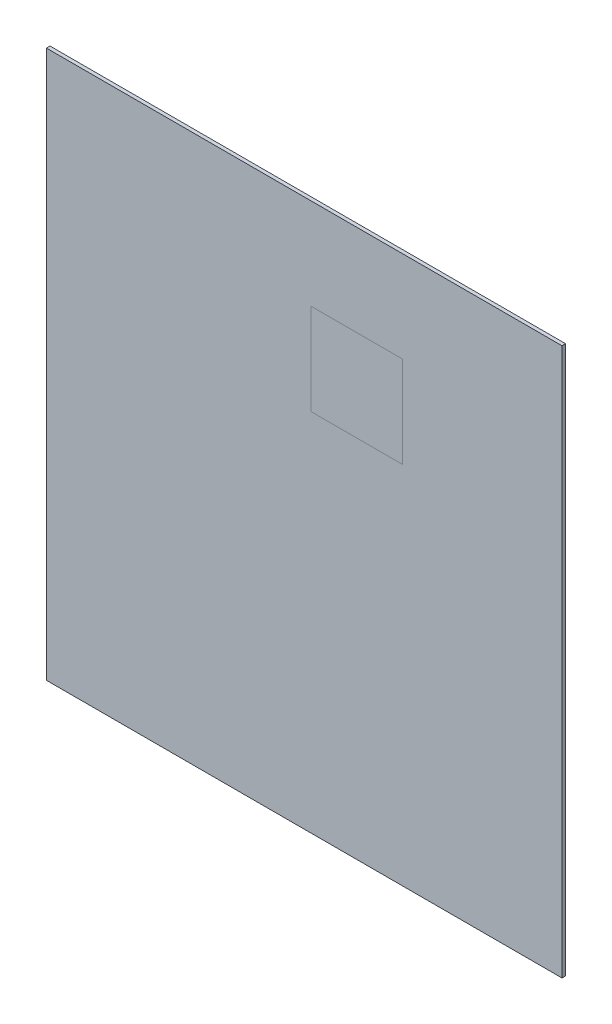
ISO-10303-21;
HEADER;
FILE_DESCRIPTION(('STEP AP214'),'2;1');
FILE_NAME('part.step','',(''),(''),'','','');
FILE_SCHEMA(('AUTOMOTIVE_DESIGN { 1 0 10303 214 1 1 1 1 }'));
ENDSEC;
DATA;
#1=APPLICATION_CONTEXT('core data for automotive mechanical design processes');
#2=APPLICATION_PROTOCOL_DEFINITION('international standard','automotive_design',2000,#1);
#3=PRODUCT_CONTEXT('',#1,'mechanical');
#4=PRODUCT('Part','Part','',(#3));
#5=PRODUCT_RELATED_PRODUCT_CATEGORY('part','',(#4));
#6=PRODUCT_DEFINITION_FORMATION('','',#4);
#7=PRODUCT_DEFINITION_CONTEXT('part definition',#1,'design');
#8=PRODUCT_DEFINITION('design','',#6,#7);
#9=PRODUCT_DEFINITION_SHAPE('','',#8);
#10=(LENGTH_UNIT() NAMED_UNIT(*) SI_UNIT(.MILLI.,.METRE.));
#11=(NAMED_UNIT(*) PLANE_ANGLE_UNIT() SI_UNIT($,.RADIAN.));
#12=(NAMED_UNIT(*) SI_UNIT($,.STERADIAN.) SOLID_ANGLE_UNIT());
#13=UNCERTAINTY_MEASURE_WITH_UNIT(LENGTH_MEASURE(1.E-05),#10,'distance_accuracy_value','');
#14=(GEOMETRIC_REPRESENTATION_CONTEXT(3) GLOBAL_UNCERTAINTY_ASSIGNED_CONTEXT((#13)) GLOBAL_UNIT_ASSIGNED_CONTEXT((#10,
#11,#12)) REPRESENTATION_CONTEXT('',''));
#15=CARTESIAN_POINT('',(0.,0.,0.));
#16=DIRECTION('',(0.,0.,1.));
#17=DIRECTION('',(1.,0.,0.));
#18=AXIS2_PLACEMENT_3D('',#15,#16,#17);
#19=CARTESIAN_POINT('',(3.,40.,-0.01));
#20=DIRECTION('',(0.,-1.,0.));
#21=DIRECTION('',(0.,0.,-1.));
#22=AXIS2_PLACEMENT_3D('',#19,#20,#21);
#23=PLANE('',#22);
#24=DIRECTION('',(-1.,0.,0.));
#25=VECTOR('',#24,1.);
#26=CARTESIAN_POINT('',(0.,40.,0.));
#27=LINE('',#26,#25);
#28=CARTESIAN_POINT('',(43.,40.,0.));
#29=VERTEX_POINT('',#28);
#30=CARTESIAN_POINT('',(3.,40.,0.));
#31=VERTEX_POINT('',#30);
#32=EDGE_CURVE('E102',#29,#31,#27,.T.);
#33=ORIENTED_EDGE('',*,*,#32,.F.);
#34=DIRECTION('',(0.,0.,1.));
#35=VECTOR('',#34,1.);
#36=CARTESIAN_POINT('',(43.,40.,-0.01));
#37=LINE('',#36,#35);
#38=CARTESIAN_POINT('',(43.,40.,1.57));
#39=VERTEX_POINT('',#38);
#40=EDGE_CURVE('E62',#29,#39,#37,.T.);
#41=ORIENTED_EDGE('',*,*,#40,.T.);
#42=DIRECTION('',(-1.,0.,0.));
#43=VECTOR('',#42,1.);
#44=CARTESIAN_POINT('',(0.,40.,1.57));
#45=LINE('',#44,#43);
#46=CARTESIAN_POINT('',(3.,40.,1.57));
#47=VERTEX_POINT('',#46);
#48=EDGE_CURVE('E57',#39,#47,#45,.T.);
#49=ORIENTED_EDGE('',*,*,#48,.T.);
#50=DIRECTION('',(0.,0.,1.));
#51=VECTOR('',#50,1.);
#52=CARTESIAN_POINT('',(3.,40.,-0.01));
#53=LINE('',#52,#51);
#54=EDGE_CURVE('E12',#31,#47,#53,.T.);
#55=ORIENTED_EDGE('',*,*,#54,.F.);
#56=EDGE_LOOP('',(#33,#41,#49,#55));
#57=FACE_BOUND('',#56,.T.);
#58=ADVANCED_FACE('F53',(#57),#23,.T.);
#59=CARTESIAN_POINT('',(43.,40.,-0.01));
#60=DIRECTION('',(1.,0.,0.));
#61=DIRECTION('',(0.,0.,-1.));
#62=AXIS2_PLACEMENT_3D('',#59,#60,#61);
#63=PLANE('',#62);
#64=DIRECTION('',(0.,-1.,0.));
#65=VECTOR('',#64,1.);
#66=CARTESIAN_POINT('',(43.,0.,0.));
#67=LINE('',#66,#65);
#68=CARTESIAN_POINT('',(43.,80.,0.));
#69=VERTEX_POINT('',#68);
#70=EDGE_CURVE('E97',#69,#29,#67,.T.);
#71=ORIENTED_EDGE('',*,*,#70,.F.);
#72=DIRECTION('',(0.,0.,1.));
#73=VECTOR('',#72,1.);
#74=CARTESIAN_POINT('',(43.,80.,-0.01));
#75=LINE('',#74,#73);
#76=CARTESIAN_POINT('',(43.,80.,1.57));
#77=VERTEX_POINT('',#76);
#78=EDGE_CURVE('E91',#69,#77,#75,.T.);
#79=ORIENTED_EDGE('',*,*,#78,.T.);
#80=DIRECTION('',(0.,-1.,0.));
#81=VECTOR('',#80,1.);
#82=CARTESIAN_POINT('',(43.,0.,1.57));
#83=LINE('',#82,#81);
#84=EDGE_CURVE('E95',#77,#39,#83,.T.);
#85=ORIENTED_EDGE('',*,*,#84,.T.);
#86=ORIENTED_EDGE('',*,*,#40,.F.);
#87=EDGE_LOOP('',(#71,#79,#85,#86));
#88=FACE_BOUND('',#87,.T.);
#89=ADVANCED_FACE('F93',(#88),#63,.T.);
#90=CARTESIAN_POINT('',(3.,40.,-0.01));
#91=DIRECTION('',(-1.,0.,0.));
#92=DIRECTION('',(0.,0.,1.));
#93=AXIS2_PLACEMENT_3D('',#90,#91,#92);
#94=PLANE('',#93);
#95=DIRECTION('',(0.,1.,0.));
#96=VECTOR('',#95,1.);
#97=CARTESIAN_POINT('',(3.,0.,0.));
#98=LINE('',#97,#96);
#99=CARTESIAN_POINT('',(3.,80.,0.));
#100=VERTEX_POINT('',#99);
#101=EDGE_CURVE('E122',#31,#100,#98,.T.);
#102=ORIENTED_EDGE('',*,*,#101,.F.);
#103=ORIENTED_EDGE('',*,*,#54,.T.);
#104=DIRECTION('',(0.,1.,0.));
#105=VECTOR('',#104,1.);
#106=CARTESIAN_POINT('',(3.,0.,1.57));
#107=LINE('',#106,#105);
#108=CARTESIAN_POINT('',(3.,80.,1.57));
#109=VERTEX_POINT('',#108);
#110=EDGE_CURVE('E110',#47,#109,#107,.T.);
#111=ORIENTED_EDGE('',*,*,#110,.T.);
#112=DIRECTION('',(0.,0.,1.));
#113=VECTOR('',#112,1.);
#114=CARTESIAN_POINT('',(3.,80.,-0.01));
#115=LINE('',#114,#113);
#116=EDGE_CURVE('E101',#100,#109,#115,.T.);
#117=ORIENTED_EDGE('',*,*,#116,.F.);
#118=EDGE_LOOP('',(#102,#103,#111,#117));
#119=FACE_BOUND('',#118,.T.);
#120=ADVANCED_FACE('F127',(#119),#94,.T.);
#121=CARTESIAN_POINT('',(3.,80.,-0.01));
#122=DIRECTION('',(0.,1.,0.));
#123=DIRECTION('',(0.,0.,1.));
#124=AXIS2_PLACEMENT_3D('',#121,#122,#123);
#125=PLANE('',#124);
#126=DIRECTION('',(1.,0.,0.));
#127=VECTOR('',#126,1.);
#128=CARTESIAN_POINT('',(0.,80.,0.));
#129=LINE('',#128,#127);
#130=EDGE_CURVE('E114',#100,#69,#129,.T.);
#131=ORIENTED_EDGE('',*,*,#130,.F.);
#132=ORIENTED_EDGE('',*,*,#116,.T.);
#133=DIRECTION('',(1.,0.,0.));
#134=VECTOR('',#133,1.);
#135=CARTESIAN_POINT('',(0.,80.,1.57));
#136=LINE('',#135,#134);
#137=EDGE_CURVE('E105',#109,#77,#136,.T.);
#138=ORIENTED_EDGE('',*,*,#137,.T.);
#139=ORIENTED_EDGE('',*,*,#78,.F.);
#140=EDGE_LOOP('',(#131,#132,#138,#139));
#141=FACE_BOUND('',#140,.T.);
#142=ADVANCED_FACE('F106',(#141),#125,.T.);
#143=CARTESIAN_POINT('',(0.,0.,0.));
#144=DIRECTION('',(0.,0.,-1.));
#145=DIRECTION('',(-1.,0.,0.));
#146=AXIS2_PLACEMENT_3D('',#143,#144,#145);
#147=PLANE('',#146);
#148=ORIENTED_EDGE('',*,*,#130,.T.);
#149=ORIENTED_EDGE('',*,*,#70,.T.);
#150=ORIENTED_EDGE('',*,*,#32,.T.);
#151=ORIENTED_EDGE('',*,*,#101,.T.);
#152=EDGE_LOOP('',(#148,#149,#150,#151));
#153=FACE_BOUND('',#152,.T.);
#154=ADVANCED_FACE('F125',(#153),#147,.T.);
#155=CARTESIAN_POINT('',(0.,0.,1.57));
#156=DIRECTION('',(0.,0.,-1.));
#157=DIRECTION('',(-1.,0.,0.));
#158=AXIS2_PLACEMENT_3D('',#155,#156,#157);
#159=PLANE('',#158);
#160=ORIENTED_EDGE('',*,*,#84,.F.);
#161=ORIENTED_EDGE('',*,*,#137,.F.);
#162=ORIENTED_EDGE('',*,*,#110,.F.);
#163=ORIENTED_EDGE('',*,*,#48,.F.);
#164=EDGE_LOOP('',(#160,#161,#162,#163));
#165=FACE_BOUND('',#164,.T.);
#166=ADVANCED_FACE('F55',(#165),#159,.F.);
#167=CLOSED_SHELL('',(#58,#89,#120,#142,#154,#166));
#168=MANIFOLD_SOLID_BREP('B2',#167);
#169=CARTESIAN_POINT('',(3.,40.,-0.01));
#170=DIRECTION('',(0.,-1.,0.));
#171=DIRECTION('',(0.,0.,-1.));
#172=AXIS2_PLACEMENT_3D('',#169,#170,#171);
#173=PLANE('',#172);
#174=DIRECTION('',(-1.,0.,0.));
#175=VECTOR('',#174,1.);
#176=CARTESIAN_POINT('',(0.,40.,0.));
#177=LINE('',#176,#175);
#178=CARTESIAN_POINT('',(43.,40.,0.));
#179=VERTEX_POINT('',#178);
#180=CARTESIAN_POINT('',(3.,40.,0.));
#181=VERTEX_POINT('',#180);
#182=EDGE_CURVE('E199',#179,#181,#177,.T.);
#183=ORIENTED_EDGE('',*,*,#182,.T.);
#184=DIRECTION('',(0.,0.,1.));
#185=VECTOR('',#184,1.);
#186=CARTESIAN_POINT('',(3.,40.,-0.01));
#187=LINE('',#186,#185);
#188=CARTESIAN_POINT('',(3.,40.,1.57));
#189=VERTEX_POINT('',#188);
#190=EDGE_CURVE('E51',#181,#189,#187,.T.);
#191=ORIENTED_EDGE('',*,*,#190,.T.);
#192=DIRECTION('',(-1.,0.,0.));
#193=VECTOR('',#192,1.);
#194=CARTESIAN_POINT('',(0.,40.,1.57));
#195=LINE('',#194,#193);
#196=CARTESIAN_POINT('',(43.,40.,1.57));
#197=VERTEX_POINT('',#196);
#198=EDGE_CURVE('E276',#197,#189,#195,.T.);
#199=ORIENTED_EDGE('',*,*,#198,.F.);
#200=DIRECTION('',(0.,0.,1.));
#201=VECTOR('',#200,1.);
#202=CARTESIAN_POINT('',(43.,40.,-0.01));
#203=LINE('',#202,#201);
#204=EDGE_CURVE('E191',#179,#197,#203,.T.);
#205=ORIENTED_EDGE('',*,*,#204,.F.);
#206=EDGE_LOOP('',(#183,#191,#199,#205));
#207=FACE_BOUND('',#206,.T.);
#208=ADVANCED_FACE('F181',(#207),#173,.F.);
#209=CARTESIAN_POINT('',(3.,40.,-0.01));
#210=DIRECTION('',(-1.,0.,0.));
#211=DIRECTION('',(0.,0.,1.));
#212=AXIS2_PLACEMENT_3D('',#209,#210,#211);
#213=PLANE('',#212);
#214=DIRECTION('',(0.,1.,0.));
#215=VECTOR('',#214,1.);
#216=CARTESIAN_POINT('',(3.,0.,0.));
#217=LINE('',#216,#215);
#218=CARTESIAN_POINT('',(3.,80.,0.));
#219=VERTEX_POINT('',#218);
#220=EDGE_CURVE('E289',#181,#219,#217,.T.);
#221=ORIENTED_EDGE('',*,*,#220,.T.);
#222=DIRECTION('',(0.,0.,1.));
#223=VECTOR('',#222,1.);
#224=CARTESIAN_POINT('',(3.,80.,-0.01));
#225=LINE('',#224,#223);
#226=CARTESIAN_POINT('',(3.,80.,1.57));
#227=VERTEX_POINT('',#226);
#228=EDGE_CURVE('E185',#219,#227,#225,.T.);
#229=ORIENTED_EDGE('',*,*,#228,.T.);
#230=DIRECTION('',(0.,1.,0.));
#231=VECTOR('',#230,1.);
#232=CARTESIAN_POINT('',(3.,0.,1.57));
#233=LINE('',#232,#231);
#234=EDGE_CURVE('E280',#189,#227,#233,.T.);
#235=ORIENTED_EDGE('',*,*,#234,.F.);
#236=ORIENTED_EDGE('',*,*,#190,.F.);
#237=EDGE_LOOP('',(#221,#229,#235,#236));
#238=FACE_BOUND('',#237,.T.);
#239=ADVANCED_FACE('F321',(#238),#213,.F.);
#240=CARTESIAN_POINT('',(3.,80.,-0.01));
#241=DIRECTION('',(0.,1.,0.));
#242=DIRECTION('',(0.,0.,1.));
#243=AXIS2_PLACEMENT_3D('',#240,#241,#242);
#244=PLANE('',#243);
#245=DIRECTION('',(1.,0.,0.));
#246=VECTOR('',#245,1.);
#247=CARTESIAN_POINT('',(0.,80.,0.));
#248=LINE('',#247,#246);
#249=CARTESIAN_POINT('',(43.,80.,0.));
#250=VERTEX_POINT('',#249);
#251=EDGE_CURVE('E292',#219,#250,#248,.T.);
#252=ORIENTED_EDGE('',*,*,#251,.T.);
#253=DIRECTION('',(0.,0.,1.));
#254=VECTOR('',#253,1.);
#255=CARTESIAN_POINT('',(43.,80.,-0.01));
#256=LINE('',#255,#254);
#257=CARTESIAN_POINT('',(43.,80.,1.57));
#258=VERTEX_POINT('',#257);
#259=EDGE_CURVE('E288',#250,#258,#256,.T.);
#260=ORIENTED_EDGE('',*,*,#259,.T.);
#261=DIRECTION('',(1.,0.,0.));
#262=VECTOR('',#261,1.);
#263=CARTESIAN_POINT('',(0.,80.,1.57));
#264=LINE('',#263,#262);
#265=EDGE_CURVE('E302',#227,#258,#264,.T.);
#266=ORIENTED_EDGE('',*,*,#265,.F.);
#267=ORIENTED_EDGE('',*,*,#228,.F.);
#268=EDGE_LOOP('',(#252,#260,#266,#267));
#269=FACE_BOUND('',#268,.T.);
#270=ADVANCED_FACE('F323',(#269),#244,.F.);
#271=CARTESIAN_POINT('',(43.,40.,-0.01));
#272=DIRECTION('',(1.,0.,0.));
#273=DIRECTION('',(0.,0.,-1.));
#274=AXIS2_PLACEMENT_3D('',#271,#272,#273);
#275=PLANE('',#274);
#276=DIRECTION('',(0.,-1.,0.));
#277=VECTOR('',#276,1.);
#278=CARTESIAN_POINT('',(43.,0.,0.));
#279=LINE('',#278,#277);
#280=EDGE_CURVE('E295',#250,#179,#279,.T.);
#281=ORIENTED_EDGE('',*,*,#280,.T.);
#282=ORIENTED_EDGE('',*,*,#204,.T.);
#283=DIRECTION('',(0.,-1.,0.));
#284=VECTOR('',#283,1.);
#285=CARTESIAN_POINT('',(43.,0.,1.57));
#286=LINE('',#285,#284);
#287=EDGE_CURVE('E298',#258,#197,#286,.T.);
#288=ORIENTED_EDGE('',*,*,#287,.F.);
#289=ORIENTED_EDGE('',*,*,#259,.F.);
#290=EDGE_LOOP('',(#281,#282,#288,#289));
#291=FACE_BOUND('',#290,.T.);
#292=ADVANCED_FACE('F183',(#291),#275,.F.);
#293=CARTESIAN_POINT('',(-113.,120.,1.57));
#294=DIRECTION('',(0.,-1.,0.));
#295=DIRECTION('',(0.,0.,-1.));
#296=AXIS2_PLACEMENT_3D('',#293,#294,#295);
#297=PLANE('',#296);
#298=DIRECTION('',(-1.,0.,0.));
#299=VECTOR('',#298,1.);
#300=CARTESIAN_POINT('',(-113.,120.,0.));
#301=LINE('',#300,#299);
#302=CARTESIAN_POINT('',(113.,120.,0.));
#303=VERTEX_POINT('',#302);
#304=CARTESIAN_POINT('',(-113.,120.,0.));
#305=VERTEX_POINT('',#304);
#306=EDGE_CURVE('E432',#303,#305,#301,.T.);
#307=ORIENTED_EDGE('',*,*,#306,.T.);
#308=DIRECTION('',(0.,0.,-1.));
#309=VECTOR('',#308,1.);
#310=CARTESIAN_POINT('',(-113.,120.,1.57));
#311=LINE('',#310,#309);
#312=CARTESIAN_POINT('',(-113.,120.,1.57));
#313=VERTEX_POINT('',#312);
#314=EDGE_CURVE('E255',#313,#305,#311,.T.);
#315=ORIENTED_EDGE('',*,*,#314,.F.);
#316=DIRECTION('',(-1.,0.,0.));
#317=VECTOR('',#316,1.);
#318=CARTESIAN_POINT('',(-113.,120.,1.57));
#319=LINE('',#318,#317);
#320=CARTESIAN_POINT('',(113.,120.,1.57));
#321=VERTEX_POINT('',#320);
#322=EDGE_CURVE('E248',#321,#313,#319,.T.);
#323=ORIENTED_EDGE('',*,*,#322,.F.);
#324=DIRECTION('',(0.,0.,-1.));
#325=VECTOR('',#324,1.);
#326=CARTESIAN_POINT('',(113.,120.,1.57));
#327=LINE('',#326,#325);
#328=EDGE_CURVE('E252',#321,#303,#327,.T.);
#329=ORIENTED_EDGE('',*,*,#328,.T.);
#330=EDGE_LOOP('',(#307,#315,#323,#329));
#331=FACE_BOUND('',#330,.T.);
#332=ADVANCED_FACE('F250',(#331),#297,.F.);
#333=CARTESIAN_POINT('',(-113.,-120.,1.57));
#334=DIRECTION('',(1.,0.,0.));
#335=DIRECTION('',(0.,0.,-1.));
#336=AXIS2_PLACEMENT_3D('',#333,#334,#335);
#337=PLANE('',#336);
#338=DIRECTION('',(0.,-1.,0.));
#339=VECTOR('',#338,1.);
#340=CARTESIAN_POINT('',(-113.,-120.,0.));
#341=LINE('',#340,#339);
#342=CARTESIAN_POINT('',(-113.,-120.,0.));
#343=VERTEX_POINT('',#342);
#344=EDGE_CURVE('E428',#305,#343,#341,.T.);
#345=ORIENTED_EDGE('',*,*,#344,.T.);
#346=DIRECTION('',(0.,0.,-1.));
#347=VECTOR('',#346,1.);
#348=CARTESIAN_POINT('',(-113.,-120.,1.57));
#349=LINE('',#348,#347);
#350=CARTESIAN_POINT('',(-113.,-120.,1.57));
#351=VERTEX_POINT('',#350);
#352=EDGE_CURVE('E282',#351,#343,#349,.T.);
#353=ORIENTED_EDGE('',*,*,#352,.F.);
#354=DIRECTION('',(0.,-1.,0.));
#355=VECTOR('',#354,1.);
#356=CARTESIAN_POINT('',(-113.,-120.,1.57));
#357=LINE('',#356,#355);
#358=EDGE_CURVE('E259',#313,#351,#357,.T.);
#359=ORIENTED_EDGE('',*,*,#358,.F.);
#360=ORIENTED_EDGE('',*,*,#314,.T.);
#361=EDGE_LOOP('',(#345,#353,#359,#360));
#362=FACE_BOUND('',#361,.T.);
#363=ADVANCED_FACE('F333',(#362),#337,.F.);
#364=CARTESIAN_POINT('',(-113.,-120.,1.57));
#365=DIRECTION('',(0.,1.,0.));
#366=DIRECTION('',(0.,0.,1.));
#367=AXIS2_PLACEMENT_3D('',#364,#365,#366);
#368=PLANE('',#367);
#369=DIRECTION('',(1.,0.,0.));
#370=VECTOR('',#369,1.);
#371=CARTESIAN_POINT('',(-113.,-120.,0.));
#372=LINE('',#371,#370);
#373=CARTESIAN_POINT('',(113.,-120.,0.));
#374=VERTEX_POINT('',#373);
#375=EDGE_CURVE('E270',#343,#374,#372,.T.);
#376=ORIENTED_EDGE('',*,*,#375,.T.);
#377=DIRECTION('',(0.,0.,-1.));
#378=VECTOR('',#377,1.);
#379=CARTESIAN_POINT('',(113.,-120.,1.57));
#380=LINE('',#379,#378);
#381=CARTESIAN_POINT('',(113.,-120.,1.57));
#382=VERTEX_POINT('',#381);
#383=EDGE_CURVE('E424',#382,#374,#380,.T.);
#384=ORIENTED_EDGE('',*,*,#383,.F.);
#385=DIRECTION('',(1.,0.,0.));
#386=VECTOR('',#385,1.);
#387=CARTESIAN_POINT('',(-113.,-120.,1.57));
#388=LINE('',#387,#386);
#389=EDGE_CURVE('E265',#351,#382,#388,.T.);
#390=ORIENTED_EDGE('',*,*,#389,.F.);
#391=ORIENTED_EDGE('',*,*,#352,.T.);
#392=EDGE_LOOP('',(#376,#384,#390,#391));
#393=FACE_BOUND('',#392,.T.);
#394=ADVANCED_FACE('F345',(#393),#368,.F.);
#395=CARTESIAN_POINT('',(113.,-120.,1.57));
#396=DIRECTION('',(-1.,0.,0.));
#397=DIRECTION('',(0.,0.,1.));
#398=AXIS2_PLACEMENT_3D('',#395,#396,#397);
#399=PLANE('',#398);
#400=DIRECTION('',(0.,1.,0.));
#401=VECTOR('',#400,1.);
#402=CARTESIAN_POINT('',(113.,-120.,0.));
#403=LINE('',#402,#401);
#404=EDGE_CURVE('E274',#374,#303,#403,.T.);
#405=ORIENTED_EDGE('',*,*,#404,.T.);
#406=ORIENTED_EDGE('',*,*,#328,.F.);
#407=DIRECTION('',(0.,1.,0.));
#408=VECTOR('',#407,1.);
#409=CARTESIAN_POINT('',(113.,-120.,1.57));
#410=LINE('',#409,#408);
#411=EDGE_CURVE('E260',#382,#321,#410,.T.);
#412=ORIENTED_EDGE('',*,*,#411,.F.);
#413=ORIENTED_EDGE('',*,*,#383,.T.);
#414=EDGE_LOOP('',(#405,#406,#412,#413));
#415=FACE_BOUND('',#414,.T.);
#416=ADVANCED_FACE('F272',(#415),#399,.F.);
#417=CARTESIAN_POINT('',(0.,0.,0.));
#418=DIRECTION('',(0.,0.,-1.));
#419=DIRECTION('',(-1.,0.,0.));
#420=AXIS2_PLACEMENT_3D('',#417,#418,#419);
#421=PLANE('',#420);
#422=ORIENTED_EDGE('',*,*,#280,.F.);
#423=ORIENTED_EDGE('',*,*,#251,.F.);
#424=ORIENTED_EDGE('',*,*,#220,.F.);
#425=ORIENTED_EDGE('',*,*,#182,.F.);
#426=EDGE_LOOP('',(#422,#423,#424,#425));
#427=FACE_BOUND('',#426,.T.);
#428=ORIENTED_EDGE('',*,*,#404,.F.);
#429=ORIENTED_EDGE('',*,*,#375,.F.);
#430=ORIENTED_EDGE('',*,*,#344,.F.);
#431=ORIENTED_EDGE('',*,*,#306,.F.);
#432=EDGE_LOOP('',(#428,#429,#430,#431));
#433=FACE_BOUND('',#432,.T.);
#434=ADVANCED_FACE('F325',(#427,#433),#421,.T.);
#435=CARTESIAN_POINT('',(0.,0.,1.57));
#436=DIRECTION('',(0.,0.,-1.));
#437=DIRECTION('',(-1.,0.,0.));
#438=AXIS2_PLACEMENT_3D('',#435,#436,#437);
#439=PLANE('',#438);
#440=ORIENTED_EDGE('',*,*,#265,.T.);
#441=ORIENTED_EDGE('',*,*,#287,.T.);
#442=ORIENTED_EDGE('',*,*,#198,.T.);
#443=ORIENTED_EDGE('',*,*,#234,.T.);
#444=EDGE_LOOP('',(#440,#441,#442,#443));
#445=FACE_BOUND('',#444,.T.);
#446=ORIENTED_EDGE('',*,*,#411,.T.);
#447=ORIENTED_EDGE('',*,*,#322,.T.);
#448=ORIENTED_EDGE('',*,*,#358,.T.);
#449=ORIENTED_EDGE('',*,*,#389,.T.);
#450=EDGE_LOOP('',(#446,#447,#448,#449));
#451=FACE_BOUND('',#450,.T.);
#452=ADVANCED_FACE('F263',(#445,#451),#439,.F.);
#453=CLOSED_SHELL('',(#208,#239,#270,#292,#332,#363,#394,#416,#434,#452));
#454=MANIFOLD_SOLID_BREP('B6',#453);
#455=ADVANCED_BREP_SHAPE_REPRESENTATION('',(#18,#168,#454),#14);
#456=SHAPE_DEFINITION_REPRESENTATION(#9,#455);
ENDSEC;
END-ISO-10303-21;
